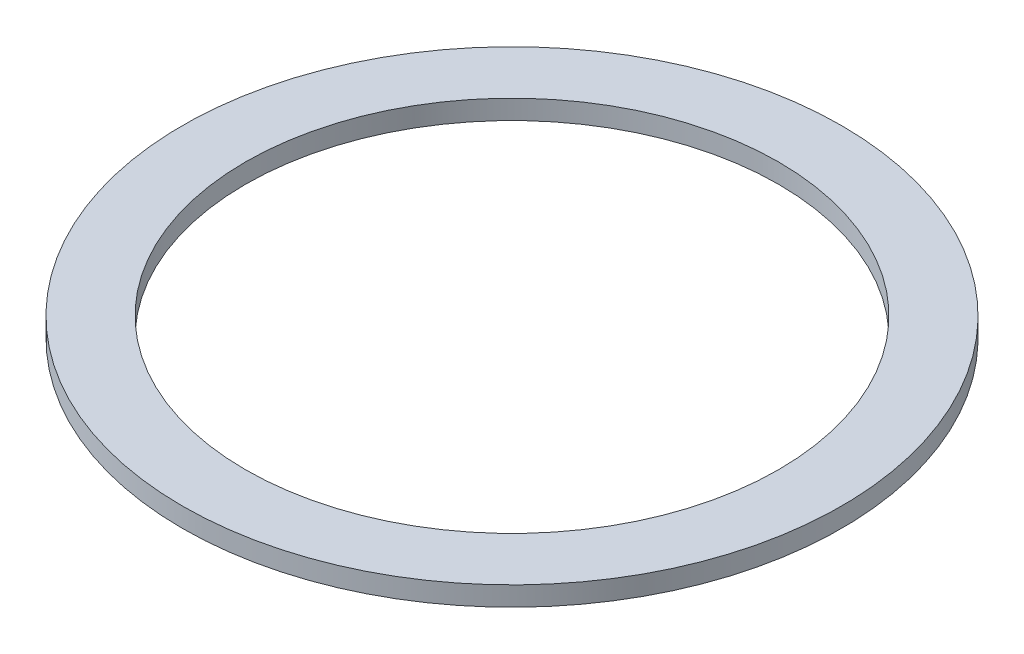
ISO-10303-21;
HEADER;
FILE_DESCRIPTION(('STEP AP214'),'2;1');
FILE_NAME('part.step','',(''),(''),'','','');
FILE_SCHEMA(('AUTOMOTIVE_DESIGN { 1 0 10303 214 1 1 1 1 }'));
ENDSEC;
DATA;
#1=APPLICATION_CONTEXT('core data for automotive mechanical design processes');
#2=APPLICATION_PROTOCOL_DEFINITION('international standard','automotive_design',2000,#1);
#3=PRODUCT_CONTEXT('',#1,'mechanical');
#4=PRODUCT('Part','Part','',(#3));
#5=PRODUCT_RELATED_PRODUCT_CATEGORY('part','',(#4));
#6=PRODUCT_DEFINITION_FORMATION('','',#4);
#7=PRODUCT_DEFINITION_CONTEXT('part definition',#1,'design');
#8=PRODUCT_DEFINITION('design','',#6,#7);
#9=PRODUCT_DEFINITION_SHAPE('','',#8);
#10=(LENGTH_UNIT() NAMED_UNIT(*) SI_UNIT(.MILLI.,.METRE.));
#11=(NAMED_UNIT(*) PLANE_ANGLE_UNIT() SI_UNIT($,.RADIAN.));
#12=(NAMED_UNIT(*) SI_UNIT($,.STERADIAN.) SOLID_ANGLE_UNIT());
#13=UNCERTAINTY_MEASURE_WITH_UNIT(LENGTH_MEASURE(1.E-05),#10,'distance_accuracy_value','');
#14=(GEOMETRIC_REPRESENTATION_CONTEXT(3) GLOBAL_UNCERTAINTY_ASSIGNED_CONTEXT((#13)) GLOBAL_UNIT_ASSIGNED_CONTEXT((#10,
#11,#12)) REPRESENTATION_CONTEXT('',''));
#15=CARTESIAN_POINT('',(0.,0.,0.));
#16=DIRECTION('',(0.,0.,1.));
#17=DIRECTION('',(1.,0.,0.));
#18=AXIS2_PLACEMENT_3D('',#15,#16,#17);
#19=CARTESIAN_POINT('',(0.,-1.,0.));
#20=DIRECTION('',(0.,1.,0.));
#21=DIRECTION('',(0.,0.,1.));
#22=AXIS2_PLACEMENT_3D('',#19,#20,#21);
#23=CYLINDRICAL_SURFACE('',#22,34.);
#24=CARTESIAN_POINT('',(0.,-1.,0.));
#25=DIRECTION('',(0.,1.,0.));
#26=DIRECTION('',(0.,0.,1.));
#27=AXIS2_PLACEMENT_3D('',#24,#25,#26);
#28=CIRCLE('',#27,34.);
#29=CARTESIAN_POINT('',(0.,-1.,34.));
#30=VERTEX_POINT('',#29);
#31=EDGE_CURVE('E10',#30,#30,#28,.T.);
#32=ORIENTED_EDGE('',*,*,#31,.T.);
#33=EDGE_LOOP('',(#32));
#34=FACE_BOUND('',#33,.T.);
#35=CARTESIAN_POINT('',(0.,0.999999999999998,0.));
#36=DIRECTION('',(0.,1.,0.));
#37=DIRECTION('',(0.,0.,1.));
#38=AXIS2_PLACEMENT_3D('',#35,#36,#37);
#39=CIRCLE('',#38,34.);
#40=CARTESIAN_POINT('',(0.,0.999999999999998,34.));
#41=VERTEX_POINT('',#40);
#42=EDGE_CURVE('E40',#41,#41,#39,.T.);
#43=ORIENTED_EDGE('',*,*,#42,.F.);
#44=EDGE_LOOP('',(#43));
#45=FACE_BOUND('',#44,.T.);
#46=ADVANCED_FACE('F30',(#34,#45),#23,.T.);
#47=CARTESIAN_POINT('',(0.,-1.,0.));
#48=DIRECTION('',(0.,1.,0.));
#49=DIRECTION('',(0.,0.,1.));
#50=AXIS2_PLACEMENT_3D('',#47,#48,#49);
#51=PLANE('',#50);
#52=CARTESIAN_POINT('',(0.,-1.,0.));
#53=DIRECTION('',(0.,1.,0.));
#54=DIRECTION('',(0.,0.,1.));
#55=AXIS2_PLACEMENT_3D('',#52,#53,#54);
#56=CIRCLE('',#55,27.5);
#57=CARTESIAN_POINT('',(0.,-1.,27.5));
#58=VERTEX_POINT('',#57);
#59=EDGE_CURVE('E36',#58,#58,#56,.T.);
#60=ORIENTED_EDGE('',*,*,#59,.T.);
#61=EDGE_LOOP('',(#60));
#62=FACE_BOUND('',#61,.T.);
#63=ORIENTED_EDGE('',*,*,#31,.F.);
#64=EDGE_LOOP('',(#63));
#65=FACE_BOUND('',#64,.T.);
#66=ADVANCED_FACE('F59',(#62,#65),#51,.F.);
#67=CARTESIAN_POINT('',(0.,-1.,0.));
#68=DIRECTION('',(0.,1.,0.));
#69=DIRECTION('',(0.,0.,1.));
#70=AXIS2_PLACEMENT_3D('',#67,#68,#69);
#71=CYLINDRICAL_SURFACE('',#70,27.5);
#72=ORIENTED_EDGE('',*,*,#59,.F.);
#73=EDGE_LOOP('',(#72));
#74=FACE_BOUND('',#73,.T.);
#75=CARTESIAN_POINT('',(0.,0.999999999999998,0.));
#76=DIRECTION('',(0.,1.,0.));
#77=DIRECTION('',(0.,0.,1.));
#78=AXIS2_PLACEMENT_3D('',#75,#76,#77);
#79=CIRCLE('',#78,27.5);
#80=CARTESIAN_POINT('',(0.,0.999999999999998,27.5));
#81=VERTEX_POINT('',#80);
#82=EDGE_CURVE('E44',#81,#81,#79,.T.);
#83=ORIENTED_EDGE('',*,*,#82,.T.);
#84=EDGE_LOOP('',(#83));
#85=FACE_BOUND('',#84,.T.);
#86=ADVANCED_FACE('F50',(#74,#85),#71,.F.);
#87=CARTESIAN_POINT('',(0.,0.999999999999998,0.));
#88=DIRECTION('',(0.,1.,0.));
#89=DIRECTION('',(0.,0.,1.));
#90=AXIS2_PLACEMENT_3D('',#87,#88,#89);
#91=PLANE('',#90);
#92=ORIENTED_EDGE('',*,*,#42,.T.);
#93=EDGE_LOOP('',(#92));
#94=FACE_BOUND('',#93,.T.);
#95=ORIENTED_EDGE('',*,*,#82,.F.);
#96=EDGE_LOOP('',(#95));
#97=FACE_BOUND('',#96,.T.);
#98=ADVANCED_FACE('F52',(#94,#97),#91,.T.);
#99=CLOSED_SHELL('',(#46,#66,#86,#98));
#100=MANIFOLD_SOLID_BREP('B2',#99);
#101=ADVANCED_BREP_SHAPE_REPRESENTATION('',(#18,#100),#14);
#102=SHAPE_DEFINITION_REPRESENTATION(#9,#101);
ENDSEC;
END-ISO-10303-21;
